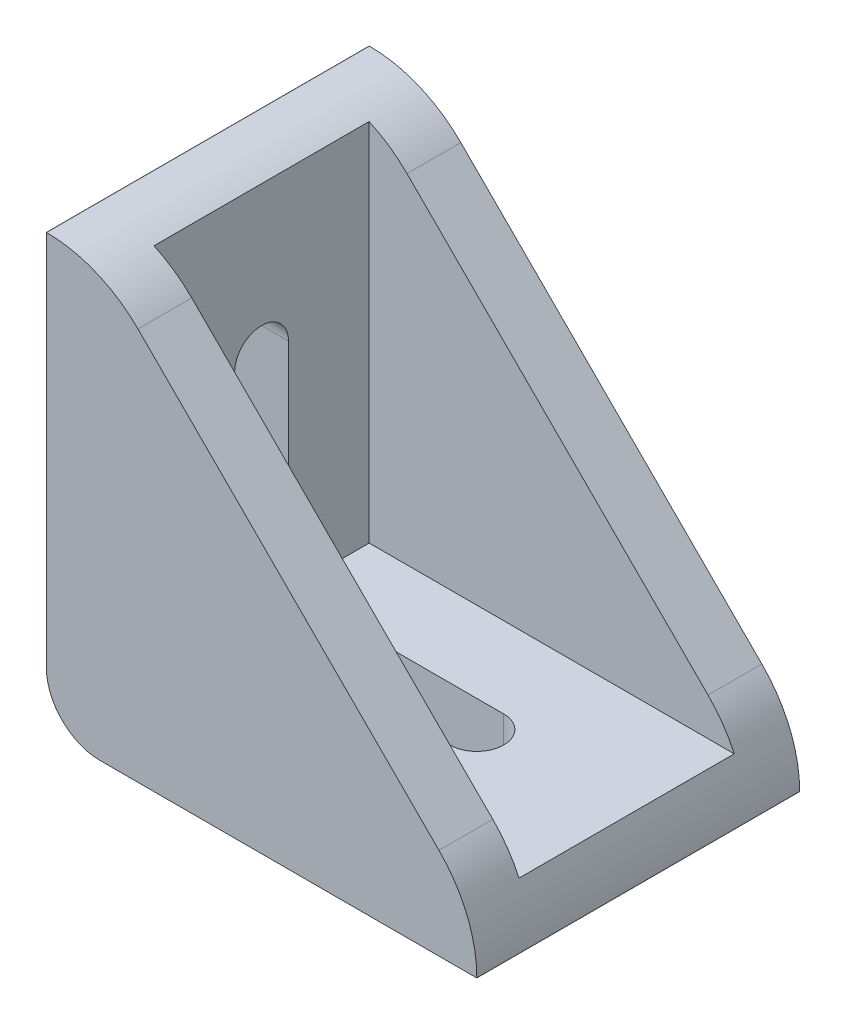
ISO-10303-21;
HEADER;
FILE_DESCRIPTION(('STEP AP214'),'2;1');
FILE_NAME('part.step','',(''),(''),'','','');
FILE_SCHEMA(('AUTOMOTIVE_DESIGN { 1 0 10303 214 1 1 1 1 }'));
ENDSEC;
DATA;
#1=APPLICATION_CONTEXT('core data for automotive mechanical design processes');
#2=APPLICATION_PROTOCOL_DEFINITION('international standard','automotive_design',2000,#1);
#3=PRODUCT_CONTEXT('',#1,'mechanical');
#4=PRODUCT('Part','Part','',(#3));
#5=PRODUCT_RELATED_PRODUCT_CATEGORY('part','',(#4));
#6=PRODUCT_DEFINITION_FORMATION('','',#4);
#7=PRODUCT_DEFINITION_CONTEXT('part definition',#1,'design');
#8=PRODUCT_DEFINITION('design','',#6,#7);
#9=PRODUCT_DEFINITION_SHAPE('','',#8);
#10=(LENGTH_UNIT() NAMED_UNIT(*) SI_UNIT(.MILLI.,.METRE.));
#11=(NAMED_UNIT(*) PLANE_ANGLE_UNIT() SI_UNIT($,.RADIAN.));
#12=(NAMED_UNIT(*) SI_UNIT($,.STERADIAN.) SOLID_ANGLE_UNIT());
#13=UNCERTAINTY_MEASURE_WITH_UNIT(LENGTH_MEASURE(1.E-05),#10,'distance_accuracy_value','');
#14=(GEOMETRIC_REPRESENTATION_CONTEXT(3) GLOBAL_UNCERTAINTY_ASSIGNED_CONTEXT((#13)) GLOBAL_UNIT_ASSIGNED_CONTEXT((#10,
#11,#12)) REPRESENTATION_CONTEXT('',''));
#15=CARTESIAN_POINT('',(0.,0.,0.));
#16=DIRECTION('',(0.,0.,1.));
#17=DIRECTION('',(1.,0.,0.));
#18=AXIS2_PLACEMENT_3D('',#15,#16,#17);
#19=CARTESIAN_POINT('',(0.0294372515228577,28.,0.));
#20=DIRECTION('',(0.,0.,-1.));
#21=DIRECTION('',(-1.,0.,0.));
#22=AXIS2_PLACEMENT_3D('',#19,#20,#21);
#23=CYLINDRICAL_SURFACE('',#22,12.);
#24=DIRECTION('',(0.,0.,-1.));
#25=VECTOR('',#24,1.);
#26=CARTESIAN_POINT('',(0.0294372515228577,40.,0.));
#27=LINE('',#26,#25);
#28=CARTESIAN_POINT('',(0.0294372515228651,40.,0.));
#29=VERTEX_POINT('',#28);
#30=CARTESIAN_POINT('',(0.0294372515228651,40.,-30.));
#31=VERTEX_POINT('',#30);
#32=EDGE_CURVE('E321',#29,#31,#27,.T.);
#33=ORIENTED_EDGE('',*,*,#32,.F.);
#34=CARTESIAN_POINT('',(0.0294372515228577,28.,0.));
#35=DIRECTION('',(0.,0.,-1.));
#36=DIRECTION('',(-1.,0.,0.));
#37=AXIS2_PLACEMENT_3D('',#34,#35,#36);
#38=CIRCLE('',#37,12.);
#39=CARTESIAN_POINT('',(8.51471862576143,36.4852813742386,0.));
#40=VERTEX_POINT('',#39);
#41=EDGE_CURVE('E342',#40,#29,#38,.F.);
#42=ORIENTED_EDGE('',*,*,#41,.F.);
#43=DIRECTION('',(0.,0.,-1.));
#44=VECTOR('',#43,1.);
#45=CARTESIAN_POINT('',(8.51471862576143,36.4852813742386,-5.));
#46=LINE('',#45,#44);
#47=CARTESIAN_POINT('',(8.51471862576143,36.4852813742386,-5.));
#48=VERTEX_POINT('',#47);
#49=EDGE_CURVE('E339',#48,#40,#46,.F.);
#50=ORIENTED_EDGE('',*,*,#49,.F.);
#51=CARTESIAN_POINT('',(0.0294372515228577,28.,-5.));
#52=DIRECTION('',(0.,0.,1.));
#53=DIRECTION('',(1.,0.,0.));
#54=AXIS2_PLACEMENT_3D('',#51,#52,#53);
#55=CIRCLE('',#54,12.);
#56=CARTESIAN_POINT('',(5.,38.9221566534935,-5.));
#57=VERTEX_POINT('',#56);
#58=EDGE_CURVE('E336',#57,#48,#55,.F.);
#59=ORIENTED_EDGE('',*,*,#58,.F.);
#60=DIRECTION('',(0.,0.,-1.));
#61=VECTOR('',#60,1.);
#62=CARTESIAN_POINT('',(5.,38.9221566534935,0.));
#63=LINE('',#62,#61);
#64=CARTESIAN_POINT('',(5.,38.9221566534935,-25.));
#65=VERTEX_POINT('',#64);
#66=EDGE_CURVE('E333',#65,#57,#63,.F.);
#67=ORIENTED_EDGE('',*,*,#66,.F.);
#68=CARTESIAN_POINT('',(0.0294372515228577,28.,-25.));
#69=DIRECTION('',(0.,0.,-1.));
#70=DIRECTION('',(-1.,0.,0.));
#71=AXIS2_PLACEMENT_3D('',#68,#69,#70);
#72=CIRCLE('',#71,12.);
#73=CARTESIAN_POINT('',(8.51471862576143,36.4852813742386,-25.));
#74=VERTEX_POINT('',#73);
#75=EDGE_CURVE('E330',#74,#65,#72,.F.);
#76=ORIENTED_EDGE('',*,*,#75,.F.);
#77=DIRECTION('',(0.,0.,-1.));
#78=VECTOR('',#77,1.);
#79=CARTESIAN_POINT('',(8.51471862576143,36.4852813742386,0.));
#80=LINE('',#79,#78);
#81=CARTESIAN_POINT('',(8.51471862576143,36.4852813742386,-30.));
#82=VERTEX_POINT('',#81);
#83=EDGE_CURVE('E327',#82,#74,#80,.F.);
#84=ORIENTED_EDGE('',*,*,#83,.F.);
#85=CARTESIAN_POINT('',(0.0294372515228577,28.,-30.));
#86=DIRECTION('',(0.,0.,1.));
#87=DIRECTION('',(1.,0.,0.));
#88=AXIS2_PLACEMENT_3D('',#85,#86,#87);
#89=CIRCLE('',#88,12.);
#90=EDGE_CURVE('E324',#31,#82,#89,.F.);
#91=ORIENTED_EDGE('',*,*,#90,.F.);
#92=EDGE_LOOP('',(#33,#42,#50,#59,#67,#76,#84,#91));
#93=FACE_BOUND('',#92,.T.);
#94=ADVANCED_FACE('F33',(#93),#23,.T.);
#95=CARTESIAN_POINT('',(28.,0.029437251522854,0.));
#96=DIRECTION('',(0.,0.,-1.));
#97=DIRECTION('',(-1.,0.,0.));
#98=AXIS2_PLACEMENT_3D('',#95,#96,#97);
#99=CYLINDRICAL_SURFACE('',#98,12.);
#100=DIRECTION('',(0.,0.,1.));
#101=VECTOR('',#100,1.);
#102=CARTESIAN_POINT('',(40.,0.029437251522854,0.));
#103=LINE('',#102,#101);
#104=CARTESIAN_POINT('',(40.,0.0294372515228626,-30.));
#105=VERTEX_POINT('',#104);
#106=CARTESIAN_POINT('',(40.,0.0294372515228626,0.));
#107=VERTEX_POINT('',#106);
#108=EDGE_CURVE('E298',#105,#107,#103,.T.);
#109=ORIENTED_EDGE('',*,*,#108,.F.);
#110=CARTESIAN_POINT('',(28.,0.029437251522854,-30.));
#111=DIRECTION('',(0.,0.,1.));
#112=DIRECTION('',(1.,0.,0.));
#113=AXIS2_PLACEMENT_3D('',#110,#111,#112);
#114=CIRCLE('',#113,12.);
#115=CARTESIAN_POINT('',(36.4852813742386,8.51471862576143,-30.));
#116=VERTEX_POINT('',#115);
#117=EDGE_CURVE('E319',#116,#105,#114,.F.);
#118=ORIENTED_EDGE('',*,*,#117,.F.);
#119=DIRECTION('',(0.,0.,1.));
#120=VECTOR('',#119,1.);
#121=CARTESIAN_POINT('',(36.4852813742386,8.51471862576143,0.));
#122=LINE('',#121,#120);
#123=CARTESIAN_POINT('',(36.4852813742386,8.51471862576143,-25.));
#124=VERTEX_POINT('',#123);
#125=EDGE_CURVE('E316',#124,#116,#122,.F.);
#126=ORIENTED_EDGE('',*,*,#125,.F.);
#127=CARTESIAN_POINT('',(28.,0.029437251522854,-25.));
#128=DIRECTION('',(0.,0.,-1.));
#129=DIRECTION('',(-1.,0.,0.));
#130=AXIS2_PLACEMENT_3D('',#127,#128,#129);
#131=CIRCLE('',#130,12.);
#132=CARTESIAN_POINT('',(38.9221566534935,5.,-25.));
#133=VERTEX_POINT('',#132);
#134=EDGE_CURVE('E313',#133,#124,#131,.F.);
#135=ORIENTED_EDGE('',*,*,#134,.F.);
#136=DIRECTION('',(0.,0.,-1.));
#137=VECTOR('',#136,1.);
#138=CARTESIAN_POINT('',(38.9221566534935,5.,0.));
#139=LINE('',#138,#137);
#140=CARTESIAN_POINT('',(38.9221566534935,5.,-5.));
#141=VERTEX_POINT('',#140);
#142=EDGE_CURVE('E310',#141,#133,#139,.T.);
#143=ORIENTED_EDGE('',*,*,#142,.F.);
#144=CARTESIAN_POINT('',(28.,0.029437251522854,-5.));
#145=DIRECTION('',(0.,0.,1.));
#146=DIRECTION('',(1.,0.,0.));
#147=AXIS2_PLACEMENT_3D('',#144,#145,#146);
#148=CIRCLE('',#147,12.);
#149=CARTESIAN_POINT('',(36.4852813742386,8.51471862576143,-5.));
#150=VERTEX_POINT('',#149);
#151=EDGE_CURVE('E307',#150,#141,#148,.F.);
#152=ORIENTED_EDGE('',*,*,#151,.F.);
#153=DIRECTION('',(0.,0.,-1.));
#154=VECTOR('',#153,1.);
#155=CARTESIAN_POINT('',(36.4852813742386,8.51471862576143,0.));
#156=LINE('',#155,#154);
#157=CARTESIAN_POINT('',(36.4852813742386,8.51471862576142,0.));
#158=VERTEX_POINT('',#157);
#159=EDGE_CURVE('E304',#158,#150,#156,.T.);
#160=ORIENTED_EDGE('',*,*,#159,.F.);
#161=CARTESIAN_POINT('',(28.,0.029437251522854,0.));
#162=DIRECTION('',(0.,0.,-1.));
#163=DIRECTION('',(-1.,0.,0.));
#164=AXIS2_PLACEMENT_3D('',#161,#162,#163);
#165=CIRCLE('',#164,12.);
#166=EDGE_CURVE('E301',#107,#158,#165,.F.);
#167=ORIENTED_EDGE('',*,*,#166,.F.);
#168=EDGE_LOOP('',(#109,#118,#126,#135,#143,#152,#160,#167));
#169=FACE_BOUND('',#168,.T.);
#170=ADVANCED_FACE('F369',(#169),#99,.T.);
#171=CARTESIAN_POINT('',(0.,5.,0.));
#172=DIRECTION('',(0.,-1.,0.));
#173=DIRECTION('',(0.,0.,-1.));
#174=AXIS2_PLACEMENT_3D('',#171,#172,#173);
#175=PLANE('',#174);
#176=DIRECTION('',(-1.,0.,0.));
#177=VECTOR('',#176,1.);
#178=CARTESIAN_POINT('',(15.,5.,-12.5));
#179=LINE('',#178,#177);
#180=CARTESIAN_POINT('',(25.,5.,-12.5));
#181=VERTEX_POINT('',#180);
#182=CARTESIAN_POINT('',(15.,5.,-12.5));
#183=VERTEX_POINT('',#182);
#184=EDGE_CURVE('E229',#181,#183,#179,.T.);
#185=ORIENTED_EDGE('',*,*,#184,.T.);
#186=CARTESIAN_POINT('',(15.,5.,-15.));
#187=DIRECTION('',(0.,-1.,0.));
#188=DIRECTION('',(0.,0.,-1.));
#189=AXIS2_PLACEMENT_3D('',#186,#187,#188);
#190=CIRCLE('',#189,2.5);
#191=CARTESIAN_POINT('',(15.,5.,-17.5));
#192=VERTEX_POINT('',#191);
#193=EDGE_CURVE('E219',#183,#192,#190,.T.);
#194=ORIENTED_EDGE('',*,*,#193,.T.);
#195=DIRECTION('',(1.,0.,0.));
#196=VECTOR('',#195,1.);
#197=CARTESIAN_POINT('',(15.,5.,-17.5));
#198=LINE('',#197,#196);
#199=CARTESIAN_POINT('',(25.,5.,-17.5));
#200=VERTEX_POINT('',#199);
#201=EDGE_CURVE('E222',#192,#200,#198,.T.);
#202=ORIENTED_EDGE('',*,*,#201,.T.);
#203=CARTESIAN_POINT('',(25.,5.,-15.));
#204=DIRECTION('',(0.,-1.,0.));
#205=DIRECTION('',(0.,0.,-1.));
#206=AXIS2_PLACEMENT_3D('',#203,#204,#205);
#207=CIRCLE('',#206,2.5);
#208=EDGE_CURVE('E226',#200,#181,#207,.T.);
#209=ORIENTED_EDGE('',*,*,#208,.T.);
#210=EDGE_LOOP('',(#185,#194,#202,#209));
#211=FACE_BOUND('',#210,.T.);
#212=DIRECTION('',(1.,0.,0.));
#213=VECTOR('',#212,1.);
#214=CARTESIAN_POINT('',(40.,5.,-5.));
#215=LINE('',#214,#213);
#216=CARTESIAN_POINT('',(5.,5.,-5.));
#217=VERTEX_POINT('',#216);
#218=EDGE_CURVE('E262',#217,#141,#215,.T.);
#219=ORIENTED_EDGE('',*,*,#218,.T.);
#220=ORIENTED_EDGE('',*,*,#142,.T.);
#221=DIRECTION('',(-1.,0.,0.));
#222=VECTOR('',#221,1.);
#223=CARTESIAN_POINT('',(5.,5.,-25.));
#224=LINE('',#223,#222);
#225=CARTESIAN_POINT('',(5.,5.,-25.));
#226=VERTEX_POINT('',#225);
#227=EDGE_CURVE('E251',#133,#226,#224,.T.);
#228=ORIENTED_EDGE('',*,*,#227,.T.);
#229=DIRECTION('',(0.,0.,-1.));
#230=VECTOR('',#229,1.);
#231=CARTESIAN_POINT('',(5.,5.,-30.));
#232=LINE('',#231,#230);
#233=EDGE_CURVE('E268',#217,#226,#232,.T.);
#234=ORIENTED_EDGE('',*,*,#233,.F.);
#235=EDGE_LOOP('',(#219,#220,#228,#234));
#236=FACE_BOUND('',#235,.T.);
#237=ADVANCED_FACE('F374',(#211,#236),#175,.F.);
#238=CARTESIAN_POINT('',(5.,40.,-30.));
#239=DIRECTION('',(-1.,0.,0.));
#240=DIRECTION('',(0.,0.,1.));
#241=AXIS2_PLACEMENT_3D('',#238,#239,#240);
#242=PLANE('',#241);
#243=DIRECTION('',(0.,1.,0.));
#244=VECTOR('',#243,1.);
#245=CARTESIAN_POINT('',(5.,25.,-12.5));
#246=LINE('',#245,#244);
#247=CARTESIAN_POINT('',(5.,15.,-12.5));
#248=VERTEX_POINT('',#247);
#249=CARTESIAN_POINT('',(5.,25.,-12.5));
#250=VERTEX_POINT('',#249);
#251=EDGE_CURVE('E187',#248,#250,#246,.T.);
#252=ORIENTED_EDGE('',*,*,#251,.T.);
#253=CARTESIAN_POINT('',(5.,25.,-15.));
#254=DIRECTION('',(-1.,0.,0.));
#255=DIRECTION('',(0.,0.,1.));
#256=AXIS2_PLACEMENT_3D('',#253,#254,#255);
#257=CIRCLE('',#256,2.5);
#258=CARTESIAN_POINT('',(5.,25.,-17.5));
#259=VERTEX_POINT('',#258);
#260=EDGE_CURVE('E179',#250,#259,#257,.T.);
#261=ORIENTED_EDGE('',*,*,#260,.T.);
#262=DIRECTION('',(0.,-1.,0.));
#263=VECTOR('',#262,1.);
#264=CARTESIAN_POINT('',(5.,25.,-17.5));
#265=LINE('',#264,#263);
#266=CARTESIAN_POINT('',(5.,15.,-17.5));
#267=VERTEX_POINT('',#266);
#268=EDGE_CURVE('E191',#259,#267,#265,.T.);
#269=ORIENTED_EDGE('',*,*,#268,.T.);
#270=CARTESIAN_POINT('',(5.,15.,-15.));
#271=DIRECTION('',(-1.,0.,0.));
#272=DIRECTION('',(0.,0.,1.));
#273=AXIS2_PLACEMENT_3D('',#270,#271,#272);
#274=CIRCLE('',#273,2.5);
#275=EDGE_CURVE('E195',#267,#248,#274,.T.);
#276=ORIENTED_EDGE('',*,*,#275,.T.);
#277=EDGE_LOOP('',(#252,#261,#269,#276));
#278=FACE_BOUND('',#277,.T.);
#279=DIRECTION('',(0.,1.,0.));
#280=VECTOR('',#279,1.);
#281=CARTESIAN_POINT('',(5.,40.,-25.));
#282=LINE('',#281,#280);
#283=EDGE_CURVE('E253',#226,#65,#282,.T.);
#284=ORIENTED_EDGE('',*,*,#283,.T.);
#285=ORIENTED_EDGE('',*,*,#66,.T.);
#286=DIRECTION('',(0.,-1.,0.));
#287=VECTOR('',#286,1.);
#288=CARTESIAN_POINT('',(5.,5.,-5.));
#289=LINE('',#288,#287);
#290=EDGE_CURVE('E260',#57,#217,#289,.T.);
#291=ORIENTED_EDGE('',*,*,#290,.T.);
#292=ORIENTED_EDGE('',*,*,#233,.T.);
#293=EDGE_LOOP('',(#284,#285,#291,#292));
#294=FACE_BOUND('',#293,.T.);
#295=ADVANCED_FACE('F197',(#278,#294),#242,.F.);
#296=CARTESIAN_POINT('',(0.,5.,0.));
#297=DIRECTION('',(1.,0.,0.));
#298=DIRECTION('',(0.,0.,-1.));
#299=AXIS2_PLACEMENT_3D('',#296,#297,#298);
#300=PLANE('',#299);
#301=DIRECTION('',(0.,-1.,0.));
#302=VECTOR('',#301,1.);
#303=CARTESIAN_POINT('',(0.,25.,-17.5));
#304=LINE('',#303,#302);
#305=CARTESIAN_POINT('',(0.,25.,-17.5));
#306=VERTEX_POINT('',#305);
#307=CARTESIAN_POINT('',(0.,15.,-17.5));
#308=VERTEX_POINT('',#307);
#309=EDGE_CURVE('E209',#306,#308,#304,.T.);
#310=ORIENTED_EDGE('',*,*,#309,.F.);
#311=CARTESIAN_POINT('',(0.,25.,-15.));
#312=DIRECTION('',(-1.,0.,0.));
#313=DIRECTION('',(0.,0.,1.));
#314=AXIS2_PLACEMENT_3D('',#311,#312,#313);
#315=CIRCLE('',#314,2.5);
#316=CARTESIAN_POINT('',(0.,25.,-12.5));
#317=VERTEX_POINT('',#316);
#318=EDGE_CURVE('E182',#317,#306,#315,.T.);
#319=ORIENTED_EDGE('',*,*,#318,.F.);
#320=DIRECTION('',(0.,1.,0.));
#321=VECTOR('',#320,1.);
#322=CARTESIAN_POINT('',(0.,25.,-12.5));
#323=LINE('',#322,#321);
#324=CARTESIAN_POINT('',(0.,15.,-12.5));
#325=VERTEX_POINT('',#324);
#326=EDGE_CURVE('E200',#325,#317,#323,.T.);
#327=ORIENTED_EDGE('',*,*,#326,.F.);
#328=CARTESIAN_POINT('',(0.,15.,-15.));
#329=DIRECTION('',(-1.,0.,0.));
#330=DIRECTION('',(0.,0.,1.));
#331=AXIS2_PLACEMENT_3D('',#328,#329,#330);
#332=CIRCLE('',#331,2.5);
#333=EDGE_CURVE('E203',#308,#325,#332,.T.);
#334=ORIENTED_EDGE('',*,*,#333,.F.);
#335=EDGE_LOOP('',(#310,#319,#327,#334));
#336=FACE_BOUND('',#335,.T.);
#337=DIRECTION('',(0.,-1.,0.));
#338=VECTOR('',#337,1.);
#339=CARTESIAN_POINT('',(0.,5.,-30.));
#340=LINE('',#339,#338);
#341=CARTESIAN_POINT('',(0.,40.,-30.));
#342=VERTEX_POINT('',#341);
#343=CARTESIAN_POINT('',(0.,5.,-30.));
#344=VERTEX_POINT('',#343);
#345=EDGE_CURVE('E288',#342,#344,#340,.T.);
#346=ORIENTED_EDGE('',*,*,#345,.T.);
#347=DIRECTION('',(0.,0.,1.));
#348=VECTOR('',#347,1.);
#349=CARTESIAN_POINT('',(0.,5.,0.));
#350=LINE('',#349,#348);
#351=CARTESIAN_POINT('',(0.,5.,0.));
#352=VERTEX_POINT('',#351);
#353=EDGE_CURVE('E344',#344,#352,#350,.T.);
#354=ORIENTED_EDGE('',*,*,#353,.T.);
#355=DIRECTION('',(0.,-1.,0.));
#356=VECTOR('',#355,1.);
#357=CARTESIAN_POINT('',(0.,5.,0.));
#358=LINE('',#357,#356);
#359=CARTESIAN_POINT('',(0.,40.,0.));
#360=VERTEX_POINT('',#359);
#361=EDGE_CURVE('E296',#360,#352,#358,.T.);
#362=ORIENTED_EDGE('',*,*,#361,.F.);
#363=DIRECTION('',(0.,0.,1.));
#364=VECTOR('',#363,1.);
#365=CARTESIAN_POINT('',(0.,40.,-30.));
#366=LINE('',#365,#364);
#367=EDGE_CURVE('E271',#342,#360,#366,.T.);
#368=ORIENTED_EDGE('',*,*,#367,.F.);
#369=EDGE_LOOP('',(#346,#354,#362,#368));
#370=FACE_BOUND('',#369,.T.);
#371=ADVANCED_FACE('F349',(#336,#370),#300,.F.);
#372=CARTESIAN_POINT('',(0.,5.,0.));
#373=DIRECTION('',(0.,0.,-1.));
#374=DIRECTION('',(-1.,0.,0.));
#375=AXIS2_PLACEMENT_3D('',#372,#373,#374);
#376=PLANE('',#375);
#377=ORIENTED_EDGE('',*,*,#361,.T.);
#378=CARTESIAN_POINT('',(5.,5.,0.));
#379=DIRECTION('',(0.,0.,-1.));
#380=DIRECTION('',(-1.,0.,0.));
#381=AXIS2_PLACEMENT_3D('',#378,#379,#380);
#382=CIRCLE('',#381,5.);
#383=CARTESIAN_POINT('',(5.,0.,0.));
#384=VERTEX_POINT('',#383);
#385=EDGE_CURVE('E55',#352,#384,#382,.F.);
#386=ORIENTED_EDGE('',*,*,#385,.T.);
#387=DIRECTION('',(1.,0.,0.));
#388=VECTOR('',#387,1.);
#389=CARTESIAN_POINT('',(0.,0.,0.));
#390=LINE('',#389,#388);
#391=CARTESIAN_POINT('',(40.,0.,0.));
#392=VERTEX_POINT('',#391);
#393=EDGE_CURVE('E279',#384,#392,#390,.T.);
#394=ORIENTED_EDGE('',*,*,#393,.T.);
#395=DIRECTION('',(0.,-1.,0.));
#396=VECTOR('',#395,1.);
#397=CARTESIAN_POINT('',(40.,5.,0.));
#398=LINE('',#397,#396);
#399=EDGE_CURVE('E293',#107,#392,#398,.T.);
#400=ORIENTED_EDGE('',*,*,#399,.F.);
#401=ORIENTED_EDGE('',*,*,#166,.T.);
#402=DIRECTION('',(-0.707106781186548,0.707106781186548,0.));
#403=VECTOR('',#402,1.);
#404=CARTESIAN_POINT('',(5.,40.,0.));
#405=LINE('',#404,#403);
#406=EDGE_CURVE('E258',#158,#40,#405,.T.);
#407=ORIENTED_EDGE('',*,*,#406,.T.);
#408=ORIENTED_EDGE('',*,*,#41,.T.);
#409=DIRECTION('',(1.,0.,0.));
#410=VECTOR('',#409,1.);
#411=CARTESIAN_POINT('',(0.,40.,0.));
#412=LINE('',#411,#410);
#413=EDGE_CURVE('E274',#360,#29,#412,.T.);
#414=ORIENTED_EDGE('',*,*,#413,.F.);
#415=EDGE_LOOP('',(#377,#386,#394,#400,#401,#407,#408,#414));
#416=FACE_BOUND('',#415,.T.);
#417=ADVANCED_FACE('F355',(#416),#376,.F.);
#418=CARTESIAN_POINT('',(40.,5.,0.));
#419=DIRECTION('',(-1.,0.,0.));
#420=DIRECTION('',(0.,0.,1.));
#421=AXIS2_PLACEMENT_3D('',#418,#419,#420);
#422=PLANE('',#421);
#423=DIRECTION('',(0.,-1.,0.));
#424=VECTOR('',#423,1.);
#425=CARTESIAN_POINT('',(40.,5.,-30.));
#426=LINE('',#425,#424);
#427=CARTESIAN_POINT('',(40.,0.,-30.));
#428=VERTEX_POINT('',#427);
#429=EDGE_CURVE('E291',#105,#428,#426,.T.);
#430=ORIENTED_EDGE('',*,*,#429,.F.);
#431=ORIENTED_EDGE('',*,*,#108,.T.);
#432=ORIENTED_EDGE('',*,*,#399,.T.);
#433=DIRECTION('',(0.,0.,-1.));
#434=VECTOR('',#433,1.);
#435=CARTESIAN_POINT('',(40.,0.,0.));
#436=LINE('',#435,#434);
#437=EDGE_CURVE('E283',#392,#428,#436,.T.);
#438=ORIENTED_EDGE('',*,*,#437,.T.);
#439=EDGE_LOOP('',(#430,#431,#432,#438));
#440=FACE_BOUND('',#439,.T.);
#441=ADVANCED_FACE('F383',(#440),#422,.F.);
#442=CARTESIAN_POINT('',(0.,5.,-30.));
#443=DIRECTION('',(0.,0.,1.));
#444=DIRECTION('',(1.,0.,0.));
#445=AXIS2_PLACEMENT_3D('',#442,#443,#444);
#446=PLANE('',#445);
#447=DIRECTION('',(-1.,0.,0.));
#448=VECTOR('',#447,1.);
#449=CARTESIAN_POINT('',(0.,0.,-30.));
#450=LINE('',#449,#448);
#451=CARTESIAN_POINT('',(5.,0.,-30.));
#452=VERTEX_POINT('',#451);
#453=EDGE_CURVE('E286',#428,#452,#450,.T.);
#454=ORIENTED_EDGE('',*,*,#453,.T.);
#455=CARTESIAN_POINT('',(5.,5.,-30.));
#456=DIRECTION('',(0.,0.,1.));
#457=DIRECTION('',(1.,0.,0.));
#458=AXIS2_PLACEMENT_3D('',#455,#456,#457);
#459=CIRCLE('',#458,5.);
#460=EDGE_CURVE('E11',#452,#344,#459,.F.);
#461=ORIENTED_EDGE('',*,*,#460,.T.);
#462=ORIENTED_EDGE('',*,*,#345,.F.);
#463=DIRECTION('',(-1.,0.,0.));
#464=VECTOR('',#463,1.);
#465=CARTESIAN_POINT('',(0.,40.,-30.));
#466=LINE('',#465,#464);
#467=EDGE_CURVE('E277',#31,#342,#466,.T.);
#468=ORIENTED_EDGE('',*,*,#467,.F.);
#469=ORIENTED_EDGE('',*,*,#90,.T.);
#470=DIRECTION('',(0.707106781186548,-0.707106781186548,0.));
#471=VECTOR('',#470,1.);
#472=CARTESIAN_POINT('',(40.,5.,-30.));
#473=LINE('',#472,#471);
#474=EDGE_CURVE('E244',#82,#116,#473,.T.);
#475=ORIENTED_EDGE('',*,*,#474,.T.);
#476=ORIENTED_EDGE('',*,*,#117,.T.);
#477=ORIENTED_EDGE('',*,*,#429,.T.);
#478=EDGE_LOOP('',(#454,#461,#462,#468,#469,#475,#476,#477));
#479=FACE_BOUND('',#478,.T.);
#480=ADVANCED_FACE('F361',(#479),#446,.F.);
#481=CARTESIAN_POINT('',(0.,0.,0.));
#482=DIRECTION('',(0.,-1.,0.));
#483=DIRECTION('',(0.,0.,-1.));
#484=AXIS2_PLACEMENT_3D('',#481,#482,#483);
#485=PLANE('',#484);
#486=CARTESIAN_POINT('',(15.,0.,-15.));
#487=DIRECTION('',(0.,-1.,0.));
#488=DIRECTION('',(0.,0.,-1.));
#489=AXIS2_PLACEMENT_3D('',#486,#487,#488);
#490=CIRCLE('',#489,2.5);
#491=CARTESIAN_POINT('',(15.,0.,-12.5));
#492=VERTEX_POINT('',#491);
#493=CARTESIAN_POINT('',(15.,0.,-17.5));
#494=VERTEX_POINT('',#493);
#495=EDGE_CURVE('E215',#492,#494,#490,.T.);
#496=ORIENTED_EDGE('',*,*,#495,.F.);
#497=DIRECTION('',(-1.,0.,0.));
#498=VECTOR('',#497,1.);
#499=CARTESIAN_POINT('',(15.,0.,-12.5));
#500=LINE('',#499,#498);
#501=CARTESIAN_POINT('',(25.,0.,-12.5));
#502=VERTEX_POINT('',#501);
#503=EDGE_CURVE('E223',#502,#492,#500,.T.);
#504=ORIENTED_EDGE('',*,*,#503,.F.);
#505=CARTESIAN_POINT('',(25.,0.,-15.));
#506=DIRECTION('',(0.,-1.,0.));
#507=DIRECTION('',(0.,0.,-1.));
#508=AXIS2_PLACEMENT_3D('',#505,#506,#507);
#509=CIRCLE('',#508,2.5);
#510=CARTESIAN_POINT('',(25.,0.,-17.5));
#511=VERTEX_POINT('',#510);
#512=EDGE_CURVE('E237',#511,#502,#509,.T.);
#513=ORIENTED_EDGE('',*,*,#512,.F.);
#514=DIRECTION('',(1.,0.,0.));
#515=VECTOR('',#514,1.);
#516=CARTESIAN_POINT('',(15.,0.,-17.5));
#517=LINE('',#516,#515);
#518=EDGE_CURVE('E234',#494,#511,#517,.T.);
#519=ORIENTED_EDGE('',*,*,#518,.F.);
#520=EDGE_LOOP('',(#496,#504,#513,#519));
#521=FACE_BOUND('',#520,.T.);
#522=ORIENTED_EDGE('',*,*,#393,.F.);
#523=DIRECTION('',(0.,0.,1.));
#524=VECTOR('',#523,1.);
#525=CARTESIAN_POINT('',(5.,0.,-30.));
#526=LINE('',#525,#524);
#527=EDGE_CURVE('E41',#384,#452,#526,.F.);
#528=ORIENTED_EDGE('',*,*,#527,.T.);
#529=ORIENTED_EDGE('',*,*,#453,.F.);
#530=ORIENTED_EDGE('',*,*,#437,.F.);
#531=EDGE_LOOP('',(#522,#528,#529,#530));
#532=FACE_BOUND('',#531,.T.);
#533=ADVANCED_FACE('F389',(#521,#532),#485,.T.);
#534=CARTESIAN_POINT('',(0.,40.,0.));
#535=DIRECTION('',(0.,1.,0.));
#536=DIRECTION('',(0.,0.,1.));
#537=AXIS2_PLACEMENT_3D('',#534,#535,#536);
#538=PLANE('',#537);
#539=ORIENTED_EDGE('',*,*,#413,.T.);
#540=ORIENTED_EDGE('',*,*,#32,.T.);
#541=ORIENTED_EDGE('',*,*,#467,.T.);
#542=ORIENTED_EDGE('',*,*,#367,.T.);
#543=EDGE_LOOP('',(#539,#540,#541,#542));
#544=FACE_BOUND('',#543,.T.);
#545=ADVANCED_FACE('F358',(#544),#538,.T.);
#546=CARTESIAN_POINT('',(5.,40.,-5.));
#547=DIRECTION('',(0.707106781186548,0.707106781186548,0.));
#548=DIRECTION('',(-0.707106781186548,0.707106781186548,0.));
#549=AXIS2_PLACEMENT_3D('',#546,#547,#548);
#550=PLANE('',#549);
#551=DIRECTION('',(-0.707106781186548,0.707106781186548,0.));
#552=VECTOR('',#551,1.);
#553=CARTESIAN_POINT('',(5.,40.,-5.));
#554=LINE('',#553,#552);
#555=EDGE_CURVE('E265',#150,#48,#554,.T.);
#556=ORIENTED_EDGE('',*,*,#555,.T.);
#557=ORIENTED_EDGE('',*,*,#49,.T.);
#558=ORIENTED_EDGE('',*,*,#406,.F.);
#559=ORIENTED_EDGE('',*,*,#159,.T.);
#560=EDGE_LOOP('',(#556,#557,#558,#559));
#561=FACE_BOUND('',#560,.T.);
#562=ADVANCED_FACE('F400',(#561),#550,.T.);
#563=CARTESIAN_POINT('',(0.,0.,-5.));
#564=DIRECTION('',(0.,0.,1.));
#565=DIRECTION('',(1.,0.,0.));
#566=AXIS2_PLACEMENT_3D('',#563,#564,#565);
#567=PLANE('',#566);
#568=ORIENTED_EDGE('',*,*,#290,.F.);
#569=ORIENTED_EDGE('',*,*,#58,.T.);
#570=ORIENTED_EDGE('',*,*,#555,.F.);
#571=ORIENTED_EDGE('',*,*,#151,.T.);
#572=ORIENTED_EDGE('',*,*,#218,.F.);
#573=EDGE_LOOP('',(#568,#569,#570,#571,#572));
#574=FACE_BOUND('',#573,.T.);
#575=ADVANCED_FACE('F403',(#574),#567,.F.);
#576=CARTESIAN_POINT('',(40.,5.,-25.));
#577=DIRECTION('',(0.707106781186548,0.707106781186548,0.));
#578=DIRECTION('',(-0.707106781186548,0.707106781186548,0.));
#579=AXIS2_PLACEMENT_3D('',#576,#577,#578);
#580=PLANE('',#579);
#581=ORIENTED_EDGE('',*,*,#474,.F.);
#582=ORIENTED_EDGE('',*,*,#83,.T.);
#583=DIRECTION('',(0.707106781186548,-0.707106781186548,0.));
#584=VECTOR('',#583,1.);
#585=CARTESIAN_POINT('',(40.,5.,-25.));
#586=LINE('',#585,#584);
#587=EDGE_CURVE('E256',#74,#124,#586,.T.);
#588=ORIENTED_EDGE('',*,*,#587,.T.);
#589=ORIENTED_EDGE('',*,*,#125,.T.);
#590=EDGE_LOOP('',(#581,#582,#588,#589));
#591=FACE_BOUND('',#590,.T.);
#592=ADVANCED_FACE('F407',(#591),#580,.T.);
#593=CARTESIAN_POINT('',(0.,0.,-25.));
#594=DIRECTION('',(0.,0.,-1.));
#595=DIRECTION('',(-1.,0.,0.));
#596=AXIS2_PLACEMENT_3D('',#593,#594,#595);
#597=PLANE('',#596);
#598=ORIENTED_EDGE('',*,*,#587,.F.);
#599=ORIENTED_EDGE('',*,*,#75,.T.);
#600=ORIENTED_EDGE('',*,*,#283,.F.);
#601=ORIENTED_EDGE('',*,*,#227,.F.);
#602=ORIENTED_EDGE('',*,*,#134,.T.);
#603=EDGE_LOOP('',(#598,#599,#600,#601,#602));
#604=FACE_BOUND('',#603,.T.);
#605=ADVANCED_FACE('F411',(#604),#597,.F.);
#606=CARTESIAN_POINT('',(15.,5.,-15.));
#607=DIRECTION('',(0.,-1.,0.));
#608=DIRECTION('',(0.,0.,-1.));
#609=AXIS2_PLACEMENT_3D('',#606,#607,#608);
#610=CYLINDRICAL_SURFACE('',#609,2.5);
#611=ORIENTED_EDGE('',*,*,#495,.T.);
#612=DIRECTION('',(0.,-1.,0.));
#613=VECTOR('',#612,1.);
#614=CARTESIAN_POINT('',(15.,5.,-17.5));
#615=LINE('',#614,#613);
#616=EDGE_CURVE('E232',#192,#494,#615,.T.);
#617=ORIENTED_EDGE('',*,*,#616,.F.);
#618=ORIENTED_EDGE('',*,*,#193,.F.);
#619=DIRECTION('',(0.,-1.,0.));
#620=VECTOR('',#619,1.);
#621=CARTESIAN_POINT('',(15.,5.,-12.5));
#622=LINE('',#621,#620);
#623=EDGE_CURVE('E242',#183,#492,#622,.T.);
#624=ORIENTED_EDGE('',*,*,#623,.T.);
#625=EDGE_LOOP('',(#611,#617,#618,#624));
#626=FACE_BOUND('',#625,.T.);
#627=ADVANCED_FACE('F415',(#626),#610,.F.);
#628=CARTESIAN_POINT('',(15.,5.,-12.5));
#629=DIRECTION('',(0.,0.,1.));
#630=DIRECTION('',(1.,0.,0.));
#631=AXIS2_PLACEMENT_3D('',#628,#629,#630);
#632=PLANE('',#631);
#633=ORIENTED_EDGE('',*,*,#503,.T.);
#634=ORIENTED_EDGE('',*,*,#623,.F.);
#635=ORIENTED_EDGE('',*,*,#184,.F.);
#636=DIRECTION('',(0.,-1.,0.));
#637=VECTOR('',#636,1.);
#638=CARTESIAN_POINT('',(25.,5.,-12.5));
#639=LINE('',#638,#637);
#640=EDGE_CURVE('E245',#181,#502,#639,.T.);
#641=ORIENTED_EDGE('',*,*,#640,.T.);
#642=EDGE_LOOP('',(#633,#634,#635,#641));
#643=FACE_BOUND('',#642,.T.);
#644=ADVANCED_FACE('F419',(#643),#632,.F.);
#645=CARTESIAN_POINT('',(25.,5.,-15.));
#646=DIRECTION('',(0.,-1.,0.));
#647=DIRECTION('',(0.,0.,-1.));
#648=AXIS2_PLACEMENT_3D('',#645,#646,#647);
#649=CYLINDRICAL_SURFACE('',#648,2.5);
#650=ORIENTED_EDGE('',*,*,#512,.T.);
#651=ORIENTED_EDGE('',*,*,#640,.F.);
#652=ORIENTED_EDGE('',*,*,#208,.F.);
#653=DIRECTION('',(0.,-1.,0.));
#654=VECTOR('',#653,1.);
#655=CARTESIAN_POINT('',(25.,5.,-17.5));
#656=LINE('',#655,#654);
#657=EDGE_CURVE('E247',#200,#511,#656,.T.);
#658=ORIENTED_EDGE('',*,*,#657,.T.);
#659=EDGE_LOOP('',(#650,#651,#652,#658));
#660=FACE_BOUND('',#659,.T.);
#661=ADVANCED_FACE('F424',(#660),#649,.F.);
#662=CARTESIAN_POINT('',(15.,5.,-17.5));
#663=DIRECTION('',(0.,0.,-1.));
#664=DIRECTION('',(-1.,0.,0.));
#665=AXIS2_PLACEMENT_3D('',#662,#663,#664);
#666=PLANE('',#665);
#667=ORIENTED_EDGE('',*,*,#518,.T.);
#668=ORIENTED_EDGE('',*,*,#657,.F.);
#669=ORIENTED_EDGE('',*,*,#201,.F.);
#670=ORIENTED_EDGE('',*,*,#616,.T.);
#671=EDGE_LOOP('',(#667,#668,#669,#670));
#672=FACE_BOUND('',#671,.T.);
#673=ADVANCED_FACE('F421',(#672),#666,.F.);
#674=CARTESIAN_POINT('',(5.,25.,-15.));
#675=DIRECTION('',(-1.,0.,0.));
#676=DIRECTION('',(0.,0.,1.));
#677=AXIS2_PLACEMENT_3D('',#674,#675,#676);
#678=CYLINDRICAL_SURFACE('',#677,2.5);
#679=ORIENTED_EDGE('',*,*,#318,.T.);
#680=DIRECTION('',(-1.,0.,0.));
#681=VECTOR('',#680,1.);
#682=CARTESIAN_POINT('',(5.,25.,-17.5));
#683=LINE('',#682,#681);
#684=EDGE_CURVE('E175',#259,#306,#683,.T.);
#685=ORIENTED_EDGE('',*,*,#684,.F.);
#686=ORIENTED_EDGE('',*,*,#260,.F.);
#687=DIRECTION('',(-1.,0.,0.));
#688=VECTOR('',#687,1.);
#689=CARTESIAN_POINT('',(5.,25.,-12.5));
#690=LINE('',#689,#688);
#691=EDGE_CURVE('E213',#250,#317,#690,.T.);
#692=ORIENTED_EDGE('',*,*,#691,.T.);
#693=EDGE_LOOP('',(#679,#685,#686,#692));
#694=FACE_BOUND('',#693,.T.);
#695=ADVANCED_FACE('F177',(#694),#678,.F.);
#696=CARTESIAN_POINT('',(5.,25.,-12.5));
#697=DIRECTION('',(0.,0.,1.));
#698=DIRECTION('',(1.,0.,0.));
#699=AXIS2_PLACEMENT_3D('',#696,#697,#698);
#700=PLANE('',#699);
#701=ORIENTED_EDGE('',*,*,#326,.T.);
#702=ORIENTED_EDGE('',*,*,#691,.F.);
#703=ORIENTED_EDGE('',*,*,#251,.F.);
#704=DIRECTION('',(-1.,0.,0.));
#705=VECTOR('',#704,1.);
#706=CARTESIAN_POINT('',(5.,15.,-12.5));
#707=LINE('',#706,#705);
#708=EDGE_CURVE('E216',#248,#325,#707,.T.);
#709=ORIENTED_EDGE('',*,*,#708,.T.);
#710=EDGE_LOOP('',(#701,#702,#703,#709));
#711=FACE_BOUND('',#710,.T.);
#712=ADVANCED_FACE('F433',(#711),#700,.F.);
#713=CARTESIAN_POINT('',(5.,15.,-15.));
#714=DIRECTION('',(-1.,0.,0.));
#715=DIRECTION('',(0.,0.,1.));
#716=AXIS2_PLACEMENT_3D('',#713,#714,#715);
#717=CYLINDRICAL_SURFACE('',#716,2.5);
#718=ORIENTED_EDGE('',*,*,#333,.T.);
#719=ORIENTED_EDGE('',*,*,#708,.F.);
#720=ORIENTED_EDGE('',*,*,#275,.F.);
#721=DIRECTION('',(-1.,0.,0.));
#722=VECTOR('',#721,1.);
#723=CARTESIAN_POINT('',(5.,15.,-17.5));
#724=LINE('',#723,#722);
#725=EDGE_CURVE('E186',#267,#308,#724,.T.);
#726=ORIENTED_EDGE('',*,*,#725,.T.);
#727=EDGE_LOOP('',(#718,#719,#720,#726));
#728=FACE_BOUND('',#727,.T.);
#729=ADVANCED_FACE('F366',(#728),#717,.F.);
#730=CARTESIAN_POINT('',(5.,25.,-17.5));
#731=DIRECTION('',(0.,0.,-1.));
#732=DIRECTION('',(0.,1.,0.));
#733=AXIS2_PLACEMENT_3D('',#730,#731,#732);
#734=PLANE('',#733);
#735=ORIENTED_EDGE('',*,*,#309,.T.);
#736=ORIENTED_EDGE('',*,*,#725,.F.);
#737=ORIENTED_EDGE('',*,*,#268,.F.);
#738=ORIENTED_EDGE('',*,*,#684,.T.);
#739=EDGE_LOOP('',(#735,#736,#737,#738));
#740=FACE_BOUND('',#739,.T.);
#741=ADVANCED_FACE('F192',(#740),#734,.F.);
#742=CARTESIAN_POINT('',(5.,5.,0.));
#743=DIRECTION('',(0.,0.,-1.));
#744=DIRECTION('',(-1.,0.,0.));
#745=AXIS2_PLACEMENT_3D('',#742,#743,#744);
#746=CYLINDRICAL_SURFACE('',#745,5.);
#747=ORIENTED_EDGE('',*,*,#460,.F.);
#748=ORIENTED_EDGE('',*,*,#527,.F.);
#749=ORIENTED_EDGE('',*,*,#385,.F.);
#750=ORIENTED_EDGE('',*,*,#353,.F.);
#751=EDGE_LOOP('',(#747,#748,#749,#750));
#752=FACE_BOUND('',#751,.T.);
#753=ADVANCED_FACE('F35',(#752),#746,.T.);
#754=CLOSED_SHELL('',(#94,#170,#237,#295,#371,#417,#441,#480,#533,#545,#562,#575,#592,#605,#627,
#644,#661,#673,#695,#712,#729,#741,#753));
#755=MANIFOLD_SOLID_BREP('B2',#754);
#756=ADVANCED_BREP_SHAPE_REPRESENTATION('',(#18,#755),#14);
#757=SHAPE_DEFINITION_REPRESENTATION(#9,#756);
ENDSEC;
END-ISO-10303-21;
